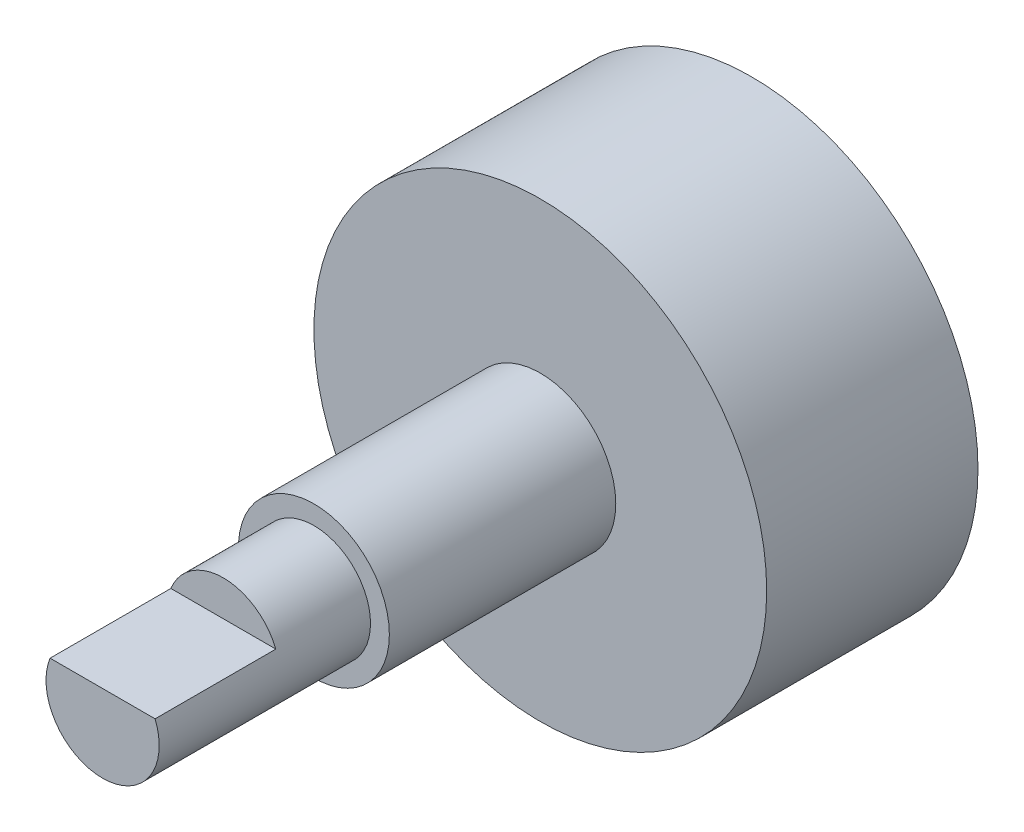
ISO-10303-21;
HEADER;
FILE_DESCRIPTION(('STEP AP214'),'2;1');
FILE_NAME('part.step','',(''),(''),'','','');
FILE_SCHEMA(('AUTOMOTIVE_DESIGN { 1 0 10303 214 1 1 1 1 }'));
ENDSEC;
DATA;
#1=APPLICATION_CONTEXT('core data for automotive mechanical design processes');
#2=APPLICATION_PROTOCOL_DEFINITION('international standard','automotive_design',2000,#1);
#3=PRODUCT_CONTEXT('',#1,'mechanical');
#4=PRODUCT('Part','Part','',(#3));
#5=PRODUCT_RELATED_PRODUCT_CATEGORY('part','',(#4));
#6=PRODUCT_DEFINITION_FORMATION('','',#4);
#7=PRODUCT_DEFINITION_CONTEXT('part definition',#1,'design');
#8=PRODUCT_DEFINITION('design','',#6,#7);
#9=PRODUCT_DEFINITION_SHAPE('','',#8);
#10=(LENGTH_UNIT() NAMED_UNIT(*) SI_UNIT(.MILLI.,.METRE.));
#11=(NAMED_UNIT(*) PLANE_ANGLE_UNIT() SI_UNIT($,.RADIAN.));
#12=(NAMED_UNIT(*) SI_UNIT($,.STERADIAN.) SOLID_ANGLE_UNIT());
#13=UNCERTAINTY_MEASURE_WITH_UNIT(LENGTH_MEASURE(1.E-05),#10,'distance_accuracy_value','');
#14=(GEOMETRIC_REPRESENTATION_CONTEXT(3) GLOBAL_UNCERTAINTY_ASSIGNED_CONTEXT((#13)) GLOBAL_UNIT_ASSIGNED_CONTEXT((#10,
#11,#12)) REPRESENTATION_CONTEXT('',''));
#15=CARTESIAN_POINT('',(0.,0.,0.));
#16=DIRECTION('',(0.,0.,1.));
#17=DIRECTION('',(1.,0.,0.));
#18=AXIS2_PLACEMENT_3D('',#15,#16,#17);
#19=CARTESIAN_POINT('',(0.,0.,9.525));
#20=DIRECTION('',(0.,0.,1.));
#21=DIRECTION('',(1.,0.,0.));
#22=AXIS2_PLACEMENT_3D('',#19,#20,#21);
#23=PLANE('',#22);
#24=CARTESIAN_POINT('',(0.,0.,9.525));
#25=DIRECTION('',(0.,0.,1.));
#26=DIRECTION('',(1.,0.,0.));
#27=AXIS2_PLACEMENT_3D('',#24,#25,#26);
#28=CIRCLE('',#27,3.175);
#29=CARTESIAN_POINT('',(3.175,0.,9.525));
#30=VERTEX_POINT('',#29);
#31=EDGE_CURVE('E77',#30,#30,#28,.T.);
#32=ORIENTED_EDGE('',*,*,#31,.T.);
#33=EDGE_LOOP('',(#32));
#34=FACE_BOUND('',#33,.T.);
#35=CARTESIAN_POINT('',(0.,0.,9.525));
#36=DIRECTION('',(0.,0.,1.));
#37=DIRECTION('',(1.,0.,0.));
#38=AXIS2_PLACEMENT_3D('',#35,#36,#37);
#39=CIRCLE('',#38,2.38125);
#40=CARTESIAN_POINT('',(2.38125,0.,9.525));
#41=VERTEX_POINT('',#40);
#42=EDGE_CURVE('E74',#41,#41,#39,.T.);
#43=ORIENTED_EDGE('',*,*,#42,.F.);
#44=EDGE_LOOP('',(#43));
#45=FACE_BOUND('',#44,.T.);
#46=ADVANCED_FACE('F35',(#34,#45),#23,.T.);
#47=CARTESIAN_POINT('',(0.,0.,0.));
#48=DIRECTION('',(0.,0.,1.));
#49=DIRECTION('',(1.,0.,0.));
#50=AXIS2_PLACEMENT_3D('',#47,#48,#49);
#51=PLANE('',#50);
#52=CARTESIAN_POINT('',(0.,0.,0.));
#53=DIRECTION('',(0.,0.,1.));
#54=DIRECTION('',(1.,0.,0.));
#55=AXIS2_PLACEMENT_3D('',#52,#53,#54);
#56=CIRCLE('',#55,9.525);
#57=CARTESIAN_POINT('',(9.525,0.,0.));
#58=VERTEX_POINT('',#57);
#59=EDGE_CURVE('E84',#58,#58,#56,.T.);
#60=ORIENTED_EDGE('',*,*,#59,.T.);
#61=EDGE_LOOP('',(#60));
#62=FACE_BOUND('',#61,.T.);
#63=CARTESIAN_POINT('',(0.,0.,0.));
#64=DIRECTION('',(0.,0.,1.));
#65=DIRECTION('',(1.,0.,0.));
#66=AXIS2_PLACEMENT_3D('',#63,#64,#65);
#67=CIRCLE('',#66,3.175);
#68=CARTESIAN_POINT('',(3.175,0.,0.));
#69=VERTEX_POINT('',#68);
#70=EDGE_CURVE('E73',#69,#69,#67,.T.);
#71=ORIENTED_EDGE('',*,*,#70,.F.);
#72=EDGE_LOOP('',(#71));
#73=FACE_BOUND('',#72,.T.);
#74=ADVANCED_FACE('F91',(#62,#73),#51,.T.);
#75=CARTESIAN_POINT('',(0.,0.,-8.89));
#76=DIRECTION('',(0.,0.,1.));
#77=DIRECTION('',(1.,0.,0.));
#78=AXIS2_PLACEMENT_3D('',#75,#76,#77);
#79=CYLINDRICAL_SURFACE('',#78,9.525);
#80=CARTESIAN_POINT('',(0.,0.,-8.89));
#81=DIRECTION('',(0.,0.,1.));
#82=DIRECTION('',(1.,0.,0.));
#83=AXIS2_PLACEMENT_3D('',#80,#81,#82);
#84=CIRCLE('',#83,9.525);
#85=CARTESIAN_POINT('',(9.525,0.,-8.89));
#86=VERTEX_POINT('',#85);
#87=EDGE_CURVE('E64',#86,#86,#84,.T.);
#88=ORIENTED_EDGE('',*,*,#87,.T.);
#89=EDGE_LOOP('',(#88));
#90=FACE_BOUND('',#89,.T.);
#91=ORIENTED_EDGE('',*,*,#59,.F.);
#92=EDGE_LOOP('',(#91));
#93=FACE_BOUND('',#92,.T.);
#94=ADVANCED_FACE('F37',(#90,#93),#79,.T.);
#95=CARTESIAN_POINT('',(0.,0.,-8.89));
#96=DIRECTION('',(0.,0.,1.));
#97=DIRECTION('',(1.,0.,0.));
#98=AXIS2_PLACEMENT_3D('',#95,#96,#97);
#99=PLANE('',#98);
#100=ORIENTED_EDGE('',*,*,#87,.F.);
#101=EDGE_LOOP('',(#100));
#102=FACE_BOUND('',#101,.T.);
#103=ADVANCED_FACE('F95',(#102),#99,.F.);
#104=CARTESIAN_POINT('',(0.,0.,9.525));
#105=DIRECTION('',(0.,0.,-1.));
#106=DIRECTION('',(-1.,0.,0.));
#107=AXIS2_PLACEMENT_3D('',#104,#105,#106);
#108=CYLINDRICAL_SURFACE('',#107,3.175);
#109=ORIENTED_EDGE('',*,*,#31,.F.);
#110=EDGE_LOOP('',(#109));
#111=FACE_BOUND('',#110,.T.);
#112=ORIENTED_EDGE('',*,*,#70,.T.);
#113=EDGE_LOOP('',(#112));
#114=FACE_BOUND('',#113,.T.);
#115=ADVANCED_FACE('F101',(#111,#114),#108,.T.);
#116=CARTESIAN_POINT('',(0.,0.,18.415));
#117=DIRECTION('',(0.,0.,-1.));
#118=DIRECTION('',(-1.,0.,0.));
#119=AXIS2_PLACEMENT_3D('',#116,#117,#118);
#120=CYLINDRICAL_SURFACE('',#119,2.38125);
#121=CARTESIAN_POINT('',(0.,0.,18.415));
#122=DIRECTION('',(0.,0.,1.));
#123=DIRECTION('',(1.,0.,0.));
#124=AXIS2_PLACEMENT_3D('',#121,#122,#123);
#125=CIRCLE('',#124,2.38125);
#126=CARTESIAN_POINT('',(-2.20907912092347,0.889,18.415));
#127=VERTEX_POINT('',#126);
#128=CARTESIAN_POINT('',(2.20907912092347,0.889,18.415));
#129=VERTEX_POINT('',#128);
#130=EDGE_CURVE('E69',#127,#129,#125,.T.);
#131=ORIENTED_EDGE('',*,*,#130,.F.);
#132=DIRECTION('',(0.,0.,-1.));
#133=VECTOR('',#132,1.);
#134=CARTESIAN_POINT('',(-2.20907912092347,0.889,18.415));
#135=LINE('',#134,#133);
#136=CARTESIAN_POINT('',(-2.20907912092347,0.889,13.335));
#137=VERTEX_POINT('',#136);
#138=EDGE_CURVE('E50',#127,#137,#135,.T.);
#139=ORIENTED_EDGE('',*,*,#138,.T.);
#140=CARTESIAN_POINT('',(0.,0.,13.335));
#141=DIRECTION('',(0.,0.,1.));
#142=DIRECTION('',(1.,0.,0.));
#143=AXIS2_PLACEMENT_3D('',#140,#141,#142);
#144=CIRCLE('',#143,2.38125);
#145=CARTESIAN_POINT('',(2.20907912092347,0.889,13.335));
#146=VERTEX_POINT('',#145);
#147=EDGE_CURVE('E11',#146,#137,#144,.T.);
#148=ORIENTED_EDGE('',*,*,#147,.F.);
#149=DIRECTION('',(0.,0.,-1.));
#150=VECTOR('',#149,1.);
#151=CARTESIAN_POINT('',(2.20907912092347,0.889,18.415));
#152=LINE('',#151,#150);
#153=EDGE_CURVE('E55',#146,#129,#152,.F.);
#154=ORIENTED_EDGE('',*,*,#153,.T.);
#155=EDGE_LOOP('',(#131,#139,#148,#154));
#156=FACE_BOUND('',#155,.T.);
#157=ORIENTED_EDGE('',*,*,#42,.T.);
#158=EDGE_LOOP('',(#157));
#159=FACE_BOUND('',#158,.T.);
#160=ADVANCED_FACE('F67',(#156,#159),#120,.T.);
#161=CARTESIAN_POINT('',(0.,0.,18.415));
#162=DIRECTION('',(0.,0.,1.));
#163=DIRECTION('',(1.,0.,0.));
#164=AXIS2_PLACEMENT_3D('',#161,#162,#163);
#165=PLANE('',#164);
#166=DIRECTION('',(1.,0.,0.));
#167=VECTOR('',#166,1.);
#168=CARTESIAN_POINT('',(0.,0.889,18.415));
#169=LINE('',#168,#167);
#170=EDGE_CURVE('E43',#127,#129,#169,.T.);
#171=ORIENTED_EDGE('',*,*,#170,.F.);
#172=ORIENTED_EDGE('',*,*,#130,.T.);
#173=EDGE_LOOP('',(#171,#172));
#174=FACE_BOUND('',#173,.T.);
#175=ADVANCED_FACE('F72',(#174),#165,.T.);
#176=CARTESIAN_POINT('',(0.,0.888999999999999,13.335));
#177=DIRECTION('',(0.,0.,1.));
#178=DIRECTION('',(1.,0.,0.));
#179=AXIS2_PLACEMENT_3D('',#176,#177,#178);
#180=PLANE('',#179);
#181=ORIENTED_EDGE('',*,*,#147,.T.);
#182=DIRECTION('',(1.,0.,0.));
#183=VECTOR('',#182,1.);
#184=CARTESIAN_POINT('',(-4.2699961991417,0.889,13.335));
#185=LINE('',#184,#183);
#186=EDGE_CURVE('E70',#137,#146,#185,.T.);
#187=ORIENTED_EDGE('',*,*,#186,.T.);
#188=EDGE_LOOP('',(#181,#187));
#189=FACE_BOUND('',#188,.T.);
#190=ADVANCED_FACE('F124',(#189),#180,.T.);
#191=CARTESIAN_POINT('',(-4.2699961991417,0.889,13.335));
#192=DIRECTION('',(0.,-1.,0.));
#193=DIRECTION('',(0.,0.,-1.));
#194=AXIS2_PLACEMENT_3D('',#191,#192,#193);
#195=PLANE('',#194);
#196=ORIENTED_EDGE('',*,*,#170,.T.);
#197=ORIENTED_EDGE('',*,*,#153,.F.);
#198=ORIENTED_EDGE('',*,*,#186,.F.);
#199=ORIENTED_EDGE('',*,*,#138,.F.);
#200=EDGE_LOOP('',(#196,#197,#198,#199));
#201=FACE_BOUND('',#200,.T.);
#202=ADVANCED_FACE('F60',(#201),#195,.F.);
#203=CLOSED_SHELL('',(#46,#74,#94,#103,#115,#160,#175,#190,#202));
#204=MANIFOLD_SOLID_BREP('B2',#203);
#205=ADVANCED_BREP_SHAPE_REPRESENTATION('',(#18,#204),#14);
#206=SHAPE_DEFINITION_REPRESENTATION(#9,#205);
ENDSEC;
END-ISO-10303-21;
